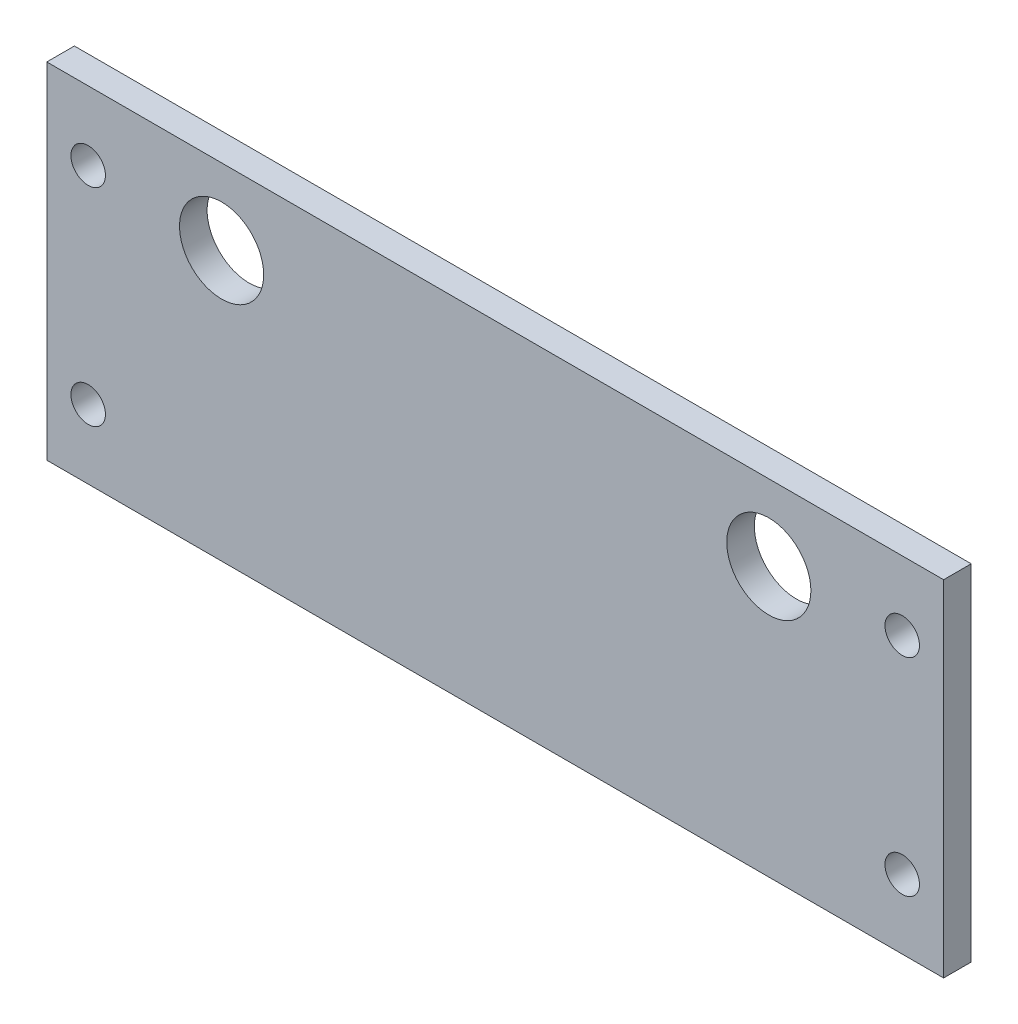
ISO-10303-21;
HEADER;
FILE_DESCRIPTION(('STEP AP214'),'2;1');
FILE_NAME('part.step','',(''),(''),'','','');
FILE_SCHEMA(('AUTOMOTIVE_DESIGN { 1 0 10303 214 1 1 1 1 }'));
ENDSEC;
DATA;
#1=APPLICATION_CONTEXT('core data for automotive mechanical design processes');
#2=APPLICATION_PROTOCOL_DEFINITION('international standard','automotive_design',2000,#1);
#3=PRODUCT_CONTEXT('',#1,'mechanical');
#4=PRODUCT('Part','Part','',(#3));
#5=PRODUCT_RELATED_PRODUCT_CATEGORY('part','',(#4));
#6=PRODUCT_DEFINITION_FORMATION('','',#4);
#7=PRODUCT_DEFINITION_CONTEXT('part definition',#1,'design');
#8=PRODUCT_DEFINITION('design','',#6,#7);
#9=PRODUCT_DEFINITION_SHAPE('','',#8);
#10=(LENGTH_UNIT() NAMED_UNIT(*) SI_UNIT(.MILLI.,.METRE.));
#11=(NAMED_UNIT(*) PLANE_ANGLE_UNIT() SI_UNIT($,.RADIAN.));
#12=(NAMED_UNIT(*) SI_UNIT($,.STERADIAN.) SOLID_ANGLE_UNIT());
#13=UNCERTAINTY_MEASURE_WITH_UNIT(LENGTH_MEASURE(1.E-05),#10,'distance_accuracy_value','');
#14=(GEOMETRIC_REPRESENTATION_CONTEXT(3) GLOBAL_UNCERTAINTY_ASSIGNED_CONTEXT((#13)) GLOBAL_UNIT_ASSIGNED_CONTEXT((#10,
#11,#12)) REPRESENTATION_CONTEXT('',''));
#15=CARTESIAN_POINT('',(0.,0.,0.));
#16=DIRECTION('',(0.,0.,1.));
#17=DIRECTION('',(1.,0.,0.));
#18=AXIS2_PLACEMENT_3D('',#15,#16,#17);
#19=CARTESIAN_POINT('',(32.5,0.,2.));
#20=DIRECTION('',(1.,0.,0.));
#21=DIRECTION('',(0.,0.,-1.));
#22=AXIS2_PLACEMENT_3D('',#19,#20,#21);
#23=PLANE('',#22);
#24=DIRECTION('',(0.,-1.,0.));
#25=VECTOR('',#24,1.);
#26=CARTESIAN_POINT('',(32.5,0.,0.));
#27=LINE('',#26,#25);
#28=CARTESIAN_POINT('',(32.5,12.5,0.));
#29=VERTEX_POINT('',#28);
#30=CARTESIAN_POINT('',(32.5,-12.5,0.));
#31=VERTEX_POINT('',#30);
#32=EDGE_CURVE('E115',#29,#31,#27,.T.);
#33=ORIENTED_EDGE('',*,*,#32,.F.);
#34=DIRECTION('',(0.,0.,-1.));
#35=VECTOR('',#34,1.);
#36=CARTESIAN_POINT('',(32.5,12.5,2.));
#37=LINE('',#36,#35);
#38=CARTESIAN_POINT('',(32.5,12.5,2.));
#39=VERTEX_POINT('',#38);
#40=EDGE_CURVE('E11',#39,#29,#37,.T.);
#41=ORIENTED_EDGE('',*,*,#40,.F.);
#42=DIRECTION('',(0.,-1.,0.));
#43=VECTOR('',#42,1.);
#44=CARTESIAN_POINT('',(32.5,0.,2.));
#45=LINE('',#44,#43);
#46=CARTESIAN_POINT('',(32.5,-12.5,2.));
#47=VERTEX_POINT('',#46);
#48=EDGE_CURVE('E101',#39,#47,#45,.T.);
#49=ORIENTED_EDGE('',*,*,#48,.T.);
#50=DIRECTION('',(0.,0.,-1.));
#51=VECTOR('',#50,1.);
#52=CARTESIAN_POINT('',(32.5,-12.5,2.));
#53=LINE('',#52,#51);
#54=EDGE_CURVE('E79',#47,#31,#53,.T.);
#55=ORIENTED_EDGE('',*,*,#54,.T.);
#56=EDGE_LOOP('',(#33,#41,#49,#55));
#57=FACE_BOUND('',#56,.T.);
#58=ADVANCED_FACE('F37',(#57),#23,.T.);
#59=CARTESIAN_POINT('',(0.,12.5,2.));
#60=DIRECTION('',(0.,1.,0.));
#61=DIRECTION('',(0.,0.,1.));
#62=AXIS2_PLACEMENT_3D('',#59,#60,#61);
#63=PLANE('',#62);
#64=DIRECTION('',(1.,0.,0.));
#65=VECTOR('',#64,1.);
#66=CARTESIAN_POINT('',(0.,12.5,0.));
#67=LINE('',#66,#65);
#68=CARTESIAN_POINT('',(-32.5,12.5,0.));
#69=VERTEX_POINT('',#68);
#70=EDGE_CURVE('E91',#69,#29,#67,.T.);
#71=ORIENTED_EDGE('',*,*,#70,.F.);
#72=DIRECTION('',(0.,0.,-1.));
#73=VECTOR('',#72,1.);
#74=CARTESIAN_POINT('',(-32.5,12.5,2.));
#75=LINE('',#74,#73);
#76=CARTESIAN_POINT('',(-32.5,12.5,2.));
#77=VERTEX_POINT('',#76);
#78=EDGE_CURVE('E47',#77,#69,#75,.T.);
#79=ORIENTED_EDGE('',*,*,#78,.F.);
#80=DIRECTION('',(1.,0.,0.));
#81=VECTOR('',#80,1.);
#82=CARTESIAN_POINT('',(0.,12.5,2.));
#83=LINE('',#82,#81);
#84=EDGE_CURVE('E89',#77,#39,#83,.T.);
#85=ORIENTED_EDGE('',*,*,#84,.T.);
#86=ORIENTED_EDGE('',*,*,#40,.T.);
#87=EDGE_LOOP('',(#71,#79,#85,#86));
#88=FACE_BOUND('',#87,.T.);
#89=ADVANCED_FACE('F87',(#88),#63,.T.);
#90=CARTESIAN_POINT('',(-32.5,0.,2.));
#91=DIRECTION('',(1.,0.,0.));
#92=DIRECTION('',(0.,0.,-1.));
#93=AXIS2_PLACEMENT_3D('',#90,#91,#92);
#94=PLANE('',#93);
#95=DIRECTION('',(0.,-1.,0.));
#96=VECTOR('',#95,1.);
#97=CARTESIAN_POINT('',(-32.5,0.,0.));
#98=LINE('',#97,#96);
#99=CARTESIAN_POINT('',(-32.5,-12.5,0.));
#100=VERTEX_POINT('',#99);
#101=EDGE_CURVE('E118',#69,#100,#98,.T.);
#102=ORIENTED_EDGE('',*,*,#101,.T.);
#103=DIRECTION('',(0.,0.,-1.));
#104=VECTOR('',#103,1.);
#105=CARTESIAN_POINT('',(-32.5,-12.5,2.));
#106=LINE('',#105,#104);
#107=CARTESIAN_POINT('',(-32.5,-12.5,2.));
#108=VERTEX_POINT('',#107);
#109=EDGE_CURVE('E94',#108,#100,#106,.T.);
#110=ORIENTED_EDGE('',*,*,#109,.F.);
#111=DIRECTION('',(0.,-1.,0.));
#112=VECTOR('',#111,1.);
#113=CARTESIAN_POINT('',(-32.5,0.,2.));
#114=LINE('',#113,#112);
#115=EDGE_CURVE('E97',#77,#108,#114,.T.);
#116=ORIENTED_EDGE('',*,*,#115,.F.);
#117=ORIENTED_EDGE('',*,*,#78,.T.);
#118=EDGE_LOOP('',(#102,#110,#116,#117));
#119=FACE_BOUND('',#118,.T.);
#120=ADVANCED_FACE('F98',(#119),#94,.F.);
#121=CARTESIAN_POINT('',(-19.83,6.99999999999999,2.));
#122=DIRECTION('',(0.,0.,-1.));
#123=DIRECTION('',(-1.,0.,0.));
#124=AXIS2_PLACEMENT_3D('',#121,#122,#123);
#125=CYLINDRICAL_SURFACE('',#124,3.05);
#126=CARTESIAN_POINT('',(-19.83,6.99999999999999,2.));
#127=DIRECTION('',(0.,0.,1.));
#128=DIRECTION('',(1.,0.,0.));
#129=AXIS2_PLACEMENT_3D('',#126,#127,#128);
#130=CIRCLE('',#129,3.05);
#131=CARTESIAN_POINT('',(-16.78,6.99999999999999,2.));
#132=VERTEX_POINT('',#131);
#133=EDGE_CURVE('E103',#132,#132,#130,.T.);
#134=ORIENTED_EDGE('',*,*,#133,.T.);
#135=EDGE_LOOP('',(#134));
#136=FACE_BOUND('',#135,.T.);
#137=CARTESIAN_POINT('',(-19.83,6.99999999999999,0.));
#138=DIRECTION('',(0.,0.,1.));
#139=DIRECTION('',(1.,0.,0.));
#140=AXIS2_PLACEMENT_3D('',#137,#138,#139);
#141=CIRCLE('',#140,3.05);
#142=CARTESIAN_POINT('',(-16.78,6.99999999999999,0.));
#143=VERTEX_POINT('',#142);
#144=EDGE_CURVE('E111',#143,#143,#141,.T.);
#145=ORIENTED_EDGE('',*,*,#144,.F.);
#146=EDGE_LOOP('',(#145));
#147=FACE_BOUND('',#146,.T.);
#148=ADVANCED_FACE('F147',(#136,#147),#125,.F.);
#149=CARTESIAN_POINT('',(19.83,7.,2.));
#150=DIRECTION('',(0.,0.,-1.));
#151=DIRECTION('',(-1.,0.,0.));
#152=AXIS2_PLACEMENT_3D('',#149,#150,#151);
#153=CYLINDRICAL_SURFACE('',#152,3.05);
#154=CARTESIAN_POINT('',(19.83,7.,2.));
#155=DIRECTION('',(0.,0.,1.));
#156=DIRECTION('',(1.,0.,0.));
#157=AXIS2_PLACEMENT_3D('',#154,#155,#156);
#158=CIRCLE('',#157,3.05);
#159=CARTESIAN_POINT('',(22.88,7.,2.));
#160=VERTEX_POINT('',#159);
#161=EDGE_CURVE('E121',#160,#160,#158,.T.);
#162=ORIENTED_EDGE('',*,*,#161,.T.);
#163=EDGE_LOOP('',(#162));
#164=FACE_BOUND('',#163,.T.);
#165=CARTESIAN_POINT('',(19.83,7.,0.));
#166=DIRECTION('',(0.,0.,1.));
#167=DIRECTION('',(1.,0.,0.));
#168=AXIS2_PLACEMENT_3D('',#165,#166,#167);
#169=CIRCLE('',#168,3.05);
#170=CARTESIAN_POINT('',(22.88,7.,0.));
#171=VERTEX_POINT('',#170);
#172=EDGE_CURVE('E108',#171,#171,#169,.T.);
#173=ORIENTED_EDGE('',*,*,#172,.F.);
#174=EDGE_LOOP('',(#173));
#175=FACE_BOUND('',#174,.T.);
#176=ADVANCED_FACE('F39',(#164,#175),#153,.F.);
#177=CARTESIAN_POINT('',(0.,-12.5,2.));
#178=DIRECTION('',(0.,1.,0.));
#179=DIRECTION('',(-1.,0.,0.));
#180=AXIS2_PLACEMENT_3D('',#177,#178,#179);
#181=PLANE('',#180);
#182=DIRECTION('',(1.,0.,0.));
#183=VECTOR('',#182,1.);
#184=CARTESIAN_POINT('',(0.,-12.5,0.));
#185=LINE('',#184,#183);
#186=EDGE_CURVE('E72',#100,#31,#185,.T.);
#187=ORIENTED_EDGE('',*,*,#186,.T.);
#188=ORIENTED_EDGE('',*,*,#54,.F.);
#189=DIRECTION('',(1.,0.,0.));
#190=VECTOR('',#189,1.);
#191=CARTESIAN_POINT('',(0.,-12.5,2.));
#192=LINE('',#191,#190);
#193=EDGE_CURVE('E56',#108,#47,#192,.T.);
#194=ORIENTED_EDGE('',*,*,#193,.F.);
#195=ORIENTED_EDGE('',*,*,#109,.T.);
#196=EDGE_LOOP('',(#187,#188,#194,#195));
#197=FACE_BOUND('',#196,.T.);
#198=ADVANCED_FACE('F152',(#197),#181,.F.);
#199=CARTESIAN_POINT('',(0.,0.,2.));
#200=DIRECTION('',(0.,0.,1.));
#201=DIRECTION('',(1.,0.,0.));
#202=AXIS2_PLACEMENT_3D('',#199,#200,#201);
#203=PLANE('',#202);
#204=CARTESIAN_POINT('',(-29.5,7.5,2.));
#205=DIRECTION('',(0.,0.,1.));
#206=DIRECTION('',(1.,0.,0.));
#207=AXIS2_PLACEMENT_3D('',#204,#205,#206);
#208=CIRCLE('',#207,1.25);
#209=CARTESIAN_POINT('',(-28.25,7.5,2.));
#210=VERTEX_POINT('',#209);
#211=EDGE_CURVE('E267',#210,#210,#208,.T.);
#212=ORIENTED_EDGE('',*,*,#211,.F.);
#213=EDGE_LOOP('',(#212));
#214=FACE_BOUND('',#213,.T.);
#215=CARTESIAN_POINT('',(-29.5,-7.5,2.));
#216=DIRECTION('',(0.,0.,1.));
#217=DIRECTION('',(1.,0.,0.));
#218=AXIS2_PLACEMENT_3D('',#215,#216,#217);
#219=CIRCLE('',#218,1.25);
#220=CARTESIAN_POINT('',(-28.25,-7.5,2.));
#221=VERTEX_POINT('',#220);
#222=EDGE_CURVE('E137',#221,#221,#219,.T.);
#223=ORIENTED_EDGE('',*,*,#222,.F.);
#224=EDGE_LOOP('',(#223));
#225=FACE_BOUND('',#224,.T.);
#226=CARTESIAN_POINT('',(29.5,7.5,2.));
#227=DIRECTION('',(0.,0.,1.));
#228=DIRECTION('',(1.,0.,0.));
#229=AXIS2_PLACEMENT_3D('',#226,#227,#228);
#230=CIRCLE('',#229,1.25);
#231=CARTESIAN_POINT('',(30.75,7.5,2.));
#232=VERTEX_POINT('',#231);
#233=EDGE_CURVE('E126',#232,#232,#230,.T.);
#234=ORIENTED_EDGE('',*,*,#233,.F.);
#235=EDGE_LOOP('',(#234));
#236=FACE_BOUND('',#235,.T.);
#237=CARTESIAN_POINT('',(29.5,-7.5,2.));
#238=DIRECTION('',(0.,0.,1.));
#239=DIRECTION('',(1.,0.,0.));
#240=AXIS2_PLACEMENT_3D('',#237,#238,#239);
#241=CIRCLE('',#240,1.25);
#242=CARTESIAN_POINT('',(30.75,-7.5,2.));
#243=VERTEX_POINT('',#242);
#244=EDGE_CURVE('E125',#243,#243,#241,.T.);
#245=ORIENTED_EDGE('',*,*,#244,.F.);
#246=EDGE_LOOP('',(#245));
#247=FACE_BOUND('',#246,.T.);
#248=ORIENTED_EDGE('',*,*,#161,.F.);
#249=EDGE_LOOP('',(#248));
#250=FACE_BOUND('',#249,.T.);
#251=ORIENTED_EDGE('',*,*,#133,.F.);
#252=EDGE_LOOP('',(#251));
#253=FACE_BOUND('',#252,.T.);
#254=ORIENTED_EDGE('',*,*,#48,.F.);
#255=ORIENTED_EDGE('',*,*,#84,.F.);
#256=ORIENTED_EDGE('',*,*,#115,.T.);
#257=ORIENTED_EDGE('',*,*,#193,.T.);
#258=EDGE_LOOP('',(#254,#255,#256,#257));
#259=FACE_BOUND('',#258,.T.);
#260=ADVANCED_FACE('F100',(#214,#225,#236,#247,#250,#253,#259),#203,.T.);
#261=CARTESIAN_POINT('',(0.,0.,0.));
#262=DIRECTION('',(0.,0.,1.));
#263=DIRECTION('',(1.,0.,0.));
#264=AXIS2_PLACEMENT_3D('',#261,#262,#263);
#265=PLANE('',#264);
#266=CARTESIAN_POINT('',(-29.5,7.5,0.));
#267=DIRECTION('',(0.,0.,1.));
#268=DIRECTION('',(1.,0.,0.));
#269=AXIS2_PLACEMENT_3D('',#266,#267,#268);
#270=CIRCLE('',#269,1.25);
#271=CARTESIAN_POINT('',(-28.25,7.5,0.));
#272=VERTEX_POINT('',#271);
#273=EDGE_CURVE('E41',#272,#272,#270,.T.);
#274=ORIENTED_EDGE('',*,*,#273,.T.);
#275=EDGE_LOOP('',(#274));
#276=FACE_BOUND('',#275,.T.);
#277=CARTESIAN_POINT('',(-29.5,-7.5,0.));
#278=DIRECTION('',(0.,0.,1.));
#279=DIRECTION('',(1.,0.,0.));
#280=AXIS2_PLACEMENT_3D('',#277,#278,#279);
#281=CIRCLE('',#280,1.25);
#282=CARTESIAN_POINT('',(-28.25,-7.5,0.));
#283=VERTEX_POINT('',#282);
#284=EDGE_CURVE('E132',#283,#283,#281,.T.);
#285=ORIENTED_EDGE('',*,*,#284,.T.);
#286=EDGE_LOOP('',(#285));
#287=FACE_BOUND('',#286,.T.);
#288=CARTESIAN_POINT('',(29.5,7.5,0.));
#289=DIRECTION('',(0.,0.,1.));
#290=DIRECTION('',(1.,0.,0.));
#291=AXIS2_PLACEMENT_3D('',#288,#289,#290);
#292=CIRCLE('',#291,1.25);
#293=CARTESIAN_POINT('',(30.75,7.5,0.));
#294=VERTEX_POINT('',#293);
#295=EDGE_CURVE('E123',#294,#294,#292,.T.);
#296=ORIENTED_EDGE('',*,*,#295,.T.);
#297=EDGE_LOOP('',(#296));
#298=FACE_BOUND('',#297,.T.);
#299=CARTESIAN_POINT('',(29.5,-7.5,0.));
#300=DIRECTION('',(0.,0.,1.));
#301=DIRECTION('',(1.,0.,0.));
#302=AXIS2_PLACEMENT_3D('',#299,#300,#301);
#303=CIRCLE('',#302,1.25);
#304=CARTESIAN_POINT('',(30.75,-7.5,0.));
#305=VERTEX_POINT('',#304);
#306=EDGE_CURVE('E112',#305,#305,#303,.T.);
#307=ORIENTED_EDGE('',*,*,#306,.T.);
#308=EDGE_LOOP('',(#307));
#309=FACE_BOUND('',#308,.T.);
#310=ORIENTED_EDGE('',*,*,#172,.T.);
#311=EDGE_LOOP('',(#310));
#312=FACE_BOUND('',#311,.T.);
#313=ORIENTED_EDGE('',*,*,#144,.T.);
#314=EDGE_LOOP('',(#313));
#315=FACE_BOUND('',#314,.T.);
#316=ORIENTED_EDGE('',*,*,#32,.T.);
#317=ORIENTED_EDGE('',*,*,#186,.F.);
#318=ORIENTED_EDGE('',*,*,#101,.F.);
#319=ORIENTED_EDGE('',*,*,#70,.T.);
#320=EDGE_LOOP('',(#316,#317,#318,#319));
#321=FACE_BOUND('',#320,.T.);
#322=ADVANCED_FACE('F151',(#276,#287,#298,#309,#312,#315,#321),#265,.F.);
#323=CARTESIAN_POINT('',(29.5,-7.5,2.));
#324=DIRECTION('',(0.,0.,1.));
#325=DIRECTION('',(1.,0.,0.));
#326=AXIS2_PLACEMENT_3D('',#323,#324,#325);
#327=CYLINDRICAL_SURFACE('',#326,1.25);
#328=ORIENTED_EDGE('',*,*,#244,.T.);
#329=EDGE_LOOP('',(#328));
#330=FACE_BOUND('',#329,.T.);
#331=ORIENTED_EDGE('',*,*,#306,.F.);
#332=EDGE_LOOP('',(#331));
#333=FACE_BOUND('',#332,.T.);
#334=ADVANCED_FACE('F159',(#330,#333),#327,.F.);
#335=CARTESIAN_POINT('',(29.5,7.5,2.));
#336=DIRECTION('',(0.,0.,1.));
#337=DIRECTION('',(1.,0.,0.));
#338=AXIS2_PLACEMENT_3D('',#335,#336,#337);
#339=CYLINDRICAL_SURFACE('',#338,1.25);
#340=ORIENTED_EDGE('',*,*,#233,.T.);
#341=EDGE_LOOP('',(#340));
#342=FACE_BOUND('',#341,.T.);
#343=ORIENTED_EDGE('',*,*,#295,.F.);
#344=EDGE_LOOP('',(#343));
#345=FACE_BOUND('',#344,.T.);
#346=ADVANCED_FACE('F225',(#342,#345),#339,.F.);
#347=CARTESIAN_POINT('',(-29.5,-7.5,2.));
#348=DIRECTION('',(0.,0.,1.));
#349=DIRECTION('',(1.,0.,0.));
#350=AXIS2_PLACEMENT_3D('',#347,#348,#349);
#351=CYLINDRICAL_SURFACE('',#350,1.25);
#352=ORIENTED_EDGE('',*,*,#222,.T.);
#353=EDGE_LOOP('',(#352));
#354=FACE_BOUND('',#353,.T.);
#355=ORIENTED_EDGE('',*,*,#284,.F.);
#356=EDGE_LOOP('',(#355));
#357=FACE_BOUND('',#356,.T.);
#358=ADVANCED_FACE('F234',(#354,#357),#351,.F.);
#359=CARTESIAN_POINT('',(-29.5,7.5,2.));
#360=DIRECTION('',(0.,0.,1.));
#361=DIRECTION('',(1.,0.,0.));
#362=AXIS2_PLACEMENT_3D('',#359,#360,#361);
#363=CYLINDRICAL_SURFACE('',#362,1.25);
#364=ORIENTED_EDGE('',*,*,#211,.T.);
#365=EDGE_LOOP('',(#364));
#366=FACE_BOUND('',#365,.T.);
#367=ORIENTED_EDGE('',*,*,#273,.F.);
#368=EDGE_LOOP('',(#367));
#369=FACE_BOUND('',#368,.T.);
#370=ADVANCED_FACE('F243',(#366,#369),#363,.F.);
#371=CLOSED_SHELL('',(#58,#89,#120,#148,#176,#198,#260,#322,#334,#346,#358,#370));
#372=MANIFOLD_SOLID_BREP('B2',#371);
#373=ADVANCED_BREP_SHAPE_REPRESENTATION('',(#18,#372),#14);
#374=SHAPE_DEFINITION_REPRESENTATION(#9,#373);
ENDSEC;
END-ISO-10303-21;
